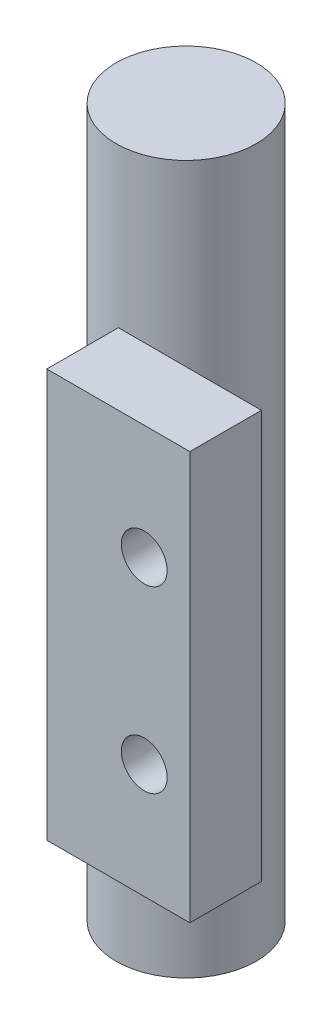
ISO-10303-21;
HEADER;
FILE_DESCRIPTION(('STEP AP214'),'2;1');
FILE_NAME('part.step','',(''),(''),'','','');
FILE_SCHEMA(('AUTOMOTIVE_DESIGN { 1 0 10303 214 1 1 1 1 }'));
ENDSEC;
DATA;
#1=APPLICATION_CONTEXT('core data for automotive mechanical design processes');
#2=APPLICATION_PROTOCOL_DEFINITION('international standard','automotive_design',2000,#1);
#3=PRODUCT_CONTEXT('',#1,'mechanical');
#4=PRODUCT('Part','Part','',(#3));
#5=PRODUCT_RELATED_PRODUCT_CATEGORY('part','',(#4));
#6=PRODUCT_DEFINITION_FORMATION('','',#4);
#7=PRODUCT_DEFINITION_CONTEXT('part definition',#1,'design');
#8=PRODUCT_DEFINITION('design','',#6,#7);
#9=PRODUCT_DEFINITION_SHAPE('','',#8);
#10=(LENGTH_UNIT() NAMED_UNIT(*) SI_UNIT(.MILLI.,.METRE.));
#11=(NAMED_UNIT(*) PLANE_ANGLE_UNIT() SI_UNIT($,.RADIAN.));
#12=(NAMED_UNIT(*) SI_UNIT($,.STERADIAN.) SOLID_ANGLE_UNIT());
#13=UNCERTAINTY_MEASURE_WITH_UNIT(LENGTH_MEASURE(1.E-05),#10,'distance_accuracy_value','');
#14=(GEOMETRIC_REPRESENTATION_CONTEXT(3) GLOBAL_UNCERTAINTY_ASSIGNED_CONTEXT((#13)) GLOBAL_UNIT_ASSIGNED_CONTEXT((#10,
#11,#12)) REPRESENTATION_CONTEXT('',''));
#15=CARTESIAN_POINT('',(0.,0.,0.));
#16=DIRECTION('',(0.,0.,1.));
#17=DIRECTION('',(1.,0.,0.));
#18=AXIS2_PLACEMENT_3D('',#15,#16,#17);
#19=CARTESIAN_POINT('',(-1.21410888509384,8.53481015756942,-5.9555332189598));
#20=DIRECTION('',(0.,-1.,0.));
#21=DIRECTION('',(1.,0.,0.));
#22=AXIS2_PLACEMENT_3D('',#19,#20,#21);
#23=CYLINDRICAL_SURFACE('',#22,4.9);
#24=CARTESIAN_POINT('',(-1.21410888509384,8.53481015756942,-5.9555332189598));
#25=DIRECTION('',(0.,-1.,0.));
#26=DIRECTION('',(1.,0.,0.));
#27=AXIS2_PLACEMENT_3D('',#24,#25,#26);
#28=CIRCLE('',#27,4.9);
#29=CARTESIAN_POINT('',(3.68589111490616,8.53481015756942,-5.9555332189598));
#30=VERTEX_POINT('',#29);
#31=EDGE_CURVE('E11',#30,#30,#28,.T.);
#32=ORIENTED_EDGE('',*,*,#31,.T.);
#33=EDGE_LOOP('',(#32));
#34=FACE_BOUND('',#33,.T.);
#35=CARTESIAN_POINT('',(-1.21410888509382,-40.9651898424306,-5.95553321895981));
#36=DIRECTION('',(0.,-1.,0.));
#37=DIRECTION('',(1.,0.,0.));
#38=AXIS2_PLACEMENT_3D('',#35,#36,#37);
#39=CIRCLE('',#38,4.9);
#40=CARTESIAN_POINT('',(3.68589111490618,-40.9651898424306,-5.95553321895981));
#41=VERTEX_POINT('',#40);
#42=EDGE_CURVE('E45',#41,#41,#39,.T.);
#43=ORIENTED_EDGE('',*,*,#42,.F.);
#44=EDGE_LOOP('',(#43));
#45=FACE_BOUND('',#44,.T.);
#46=ADVANCED_FACE('F42',(#34,#45),#23,.T.);
#47=CARTESIAN_POINT('',(-1.21410888509384,8.53481015756942,-5.9555332189598));
#48=DIRECTION('',(0.,-1.,0.));
#49=DIRECTION('',(1.,0.,0.));
#50=AXIS2_PLACEMENT_3D('',#47,#48,#49);
#51=PLANE('',#50);
#52=ORIENTED_EDGE('',*,*,#31,.F.);
#53=EDGE_LOOP('',(#52));
#54=FACE_BOUND('',#53,.T.);
#55=ADVANCED_FACE('F57',(#54),#51,.F.);
#56=CARTESIAN_POINT('',(-1.21410888509382,-40.9651898424306,-5.95553321895981));
#57=DIRECTION('',(0.,-1.,0.));
#58=DIRECTION('',(1.,0.,0.));
#59=AXIS2_PLACEMENT_3D('',#56,#57,#58);
#60=PLANE('',#59);
#61=ORIENTED_EDGE('',*,*,#42,.T.);
#62=EDGE_LOOP('',(#61));
#63=FACE_BOUND('',#62,.T.);
#64=ADVANCED_FACE('F54',(#63),#60,.T.);
#65=CLOSED_SHELL('',(#46,#55,#64));
#66=MANIFOLD_SOLID_BREP('B2',#65);
#67=CARTESIAN_POINT('',(10.,-1.47000000000001,5.));
#68=DIRECTION('',(-1.,0.,0.));
#69=DIRECTION('',(0.,-1.,0.));
#70=AXIS2_PLACEMENT_3D('',#67,#68,#69);
#71=PLANE('',#70);
#72=DIRECTION('',(0.,1.,0.));
#73=VECTOR('',#72,1.);
#74=CARTESIAN_POINT('',(10.,-1.47000000000001,0.));
#75=LINE('',#74,#73);
#76=CARTESIAN_POINT('',(10.,-30.,0.));
#77=VERTEX_POINT('',#76);
#78=CARTESIAN_POINT('',(10.,-1.47000000000001,0.));
#79=VERTEX_POINT('',#78);
#80=EDGE_CURVE('E145',#77,#79,#75,.T.);
#81=ORIENTED_EDGE('',*,*,#80,.T.);
#82=DIRECTION('',(0.,0.,-1.));
#83=VECTOR('',#82,1.);
#84=CARTESIAN_POINT('',(10.,-1.47000000000001,5.));
#85=LINE('',#84,#83);
#86=CARTESIAN_POINT('',(10.,-1.47000000000001,5.));
#87=VERTEX_POINT('',#86);
#88=EDGE_CURVE('E40',#87,#79,#85,.T.);
#89=ORIENTED_EDGE('',*,*,#88,.F.);
#90=DIRECTION('',(0.,1.,0.));
#91=VECTOR('',#90,1.);
#92=CARTESIAN_POINT('',(10.,-1.47000000000001,5.));
#93=LINE('',#92,#91);
#94=CARTESIAN_POINT('',(10.,-30.,5.));
#95=VERTEX_POINT('',#94);
#96=EDGE_CURVE('E133',#95,#87,#93,.T.);
#97=ORIENTED_EDGE('',*,*,#96,.F.);
#98=DIRECTION('',(0.,0.,-1.));
#99=VECTOR('',#98,1.);
#100=CARTESIAN_POINT('',(10.,-30.,5.));
#101=LINE('',#100,#99);
#102=EDGE_CURVE('E141',#95,#77,#101,.T.);
#103=ORIENTED_EDGE('',*,*,#102,.T.);
#104=EDGE_LOOP('',(#81,#89,#97,#103));
#105=FACE_BOUND('',#104,.T.);
#106=ADVANCED_FACE('F82',(#105),#71,.F.);
#107=CARTESIAN_POINT('',(10.,-1.47000000000001,5.));
#108=DIRECTION('',(0.,-1.,0.));
#109=DIRECTION('',(1.,0.,0.));
#110=AXIS2_PLACEMENT_3D('',#107,#108,#109);
#111=PLANE('',#110);
#112=DIRECTION('',(-1.,0.,0.));
#113=VECTOR('',#112,1.);
#114=CARTESIAN_POINT('',(10.,-1.47000000000001,0.));
#115=LINE('',#114,#113);
#116=CARTESIAN_POINT('',(0.,-1.47000000000001,0.));
#117=VERTEX_POINT('',#116);
#118=EDGE_CURVE('E137',#79,#117,#115,.T.);
#119=ORIENTED_EDGE('',*,*,#118,.T.);
#120=DIRECTION('',(0.,0.,-1.));
#121=VECTOR('',#120,1.);
#122=CARTESIAN_POINT('',(0.,-1.47000000000001,5.));
#123=LINE('',#122,#121);
#124=CARTESIAN_POINT('',(0.,-1.47000000000001,5.));
#125=VERTEX_POINT('',#124);
#126=EDGE_CURVE('E90',#125,#117,#123,.T.);
#127=ORIENTED_EDGE('',*,*,#126,.F.);
#128=DIRECTION('',(-1.,0.,0.));
#129=VECTOR('',#128,1.);
#130=CARTESIAN_POINT('',(10.,-1.47000000000001,5.));
#131=LINE('',#130,#129);
#132=EDGE_CURVE('E128',#87,#125,#131,.T.);
#133=ORIENTED_EDGE('',*,*,#132,.F.);
#134=ORIENTED_EDGE('',*,*,#88,.T.);
#135=EDGE_LOOP('',(#119,#127,#133,#134));
#136=FACE_BOUND('',#135,.T.);
#137=ADVANCED_FACE('F136',(#136),#111,.F.);
#138=CARTESIAN_POINT('',(0.,-1.47000000000001,5.));
#139=DIRECTION('',(1.,0.,0.));
#140=DIRECTION('',(0.,1.,0.));
#141=AXIS2_PLACEMENT_3D('',#138,#139,#140);
#142=PLANE('',#141);
#143=DIRECTION('',(0.,-1.,0.));
#144=VECTOR('',#143,1.);
#145=CARTESIAN_POINT('',(0.,-1.47000000000001,0.));
#146=LINE('',#145,#144);
#147=CARTESIAN_POINT('',(0.,-30.,0.));
#148=VERTEX_POINT('',#147);
#149=EDGE_CURVE('E115',#117,#148,#146,.T.);
#150=ORIENTED_EDGE('',*,*,#149,.T.);
#151=DIRECTION('',(0.,0.,-1.));
#152=VECTOR('',#151,1.);
#153=CARTESIAN_POINT('',(0.,-30.,5.));
#154=LINE('',#153,#152);
#155=CARTESIAN_POINT('',(0.,-30.,5.));
#156=VERTEX_POINT('',#155);
#157=EDGE_CURVE('E138',#156,#148,#154,.T.);
#158=ORIENTED_EDGE('',*,*,#157,.F.);
#159=DIRECTION('',(0.,-1.,0.));
#160=VECTOR('',#159,1.);
#161=CARTESIAN_POINT('',(0.,-1.47000000000001,5.));
#162=LINE('',#161,#160);
#163=EDGE_CURVE('E131',#125,#156,#162,.T.);
#164=ORIENTED_EDGE('',*,*,#163,.F.);
#165=ORIENTED_EDGE('',*,*,#126,.T.);
#166=EDGE_LOOP('',(#150,#158,#164,#165));
#167=FACE_BOUND('',#166,.T.);
#168=ADVANCED_FACE('F139',(#167),#142,.F.);
#169=CARTESIAN_POINT('',(10.,-30.,5.));
#170=DIRECTION('',(0.,1.,0.));
#171=DIRECTION('',(-1.,0.,0.));
#172=AXIS2_PLACEMENT_3D('',#169,#170,#171);
#173=PLANE('',#172);
#174=DIRECTION('',(1.,0.,0.));
#175=VECTOR('',#174,1.);
#176=CARTESIAN_POINT('',(10.,-30.,0.));
#177=LINE('',#176,#175);
#178=EDGE_CURVE('E121',#148,#77,#177,.T.);
#179=ORIENTED_EDGE('',*,*,#178,.T.);
#180=ORIENTED_EDGE('',*,*,#102,.F.);
#181=DIRECTION('',(1.,0.,0.));
#182=VECTOR('',#181,1.);
#183=CARTESIAN_POINT('',(10.,-30.,5.));
#184=LINE('',#183,#182);
#185=EDGE_CURVE('E98',#156,#95,#184,.T.);
#186=ORIENTED_EDGE('',*,*,#185,.F.);
#187=ORIENTED_EDGE('',*,*,#157,.T.);
#188=EDGE_LOOP('',(#179,#180,#186,#187));
#189=FACE_BOUND('',#188,.T.);
#190=ADVANCED_FACE('F153',(#189),#173,.F.);
#191=CARTESIAN_POINT('',(0.,0.,5.));
#192=DIRECTION('',(0.,0.,-1.));
#193=DIRECTION('',(-1.,0.,0.));
#194=AXIS2_PLACEMENT_3D('',#191,#192,#193);
#195=PLANE('',#194);
#196=CARTESIAN_POINT('',(6.81031037360218,-9.47000000000007,5.));
#197=DIRECTION('',(0.,0.,-1.));
#198=DIRECTION('',(-1.,0.,0.));
#199=AXIS2_PLACEMENT_3D('',#196,#197,#198);
#200=CIRCLE('',#199,1.6);
#201=CARTESIAN_POINT('',(5.21031037360218,-9.47000000000007,5.));
#202=VERTEX_POINT('',#201);
#203=EDGE_CURVE('E148',#202,#202,#200,.T.);
#204=ORIENTED_EDGE('',*,*,#203,.T.);
#205=EDGE_LOOP('',(#204));
#206=FACE_BOUND('',#205,.T.);
#207=CARTESIAN_POINT('',(6.81031037360219,-22.0000000000001,5.));
#208=DIRECTION('',(0.,0.,-1.));
#209=DIRECTION('',(-1.,0.,0.));
#210=AXIS2_PLACEMENT_3D('',#207,#208,#209);
#211=CIRCLE('',#210,1.6);
#212=CARTESIAN_POINT('',(5.21031037360218,-22.0000000000001,5.));
#213=VERTEX_POINT('',#212);
#214=EDGE_CURVE('E161',#213,#213,#211,.T.);
#215=ORIENTED_EDGE('',*,*,#214,.T.);
#216=EDGE_LOOP('',(#215));
#217=FACE_BOUND('',#216,.T.);
#218=ORIENTED_EDGE('',*,*,#96,.T.);
#219=ORIENTED_EDGE('',*,*,#132,.T.);
#220=ORIENTED_EDGE('',*,*,#163,.T.);
#221=ORIENTED_EDGE('',*,*,#185,.T.);
#222=EDGE_LOOP('',(#218,#219,#220,#221));
#223=FACE_BOUND('',#222,.T.);
#224=ADVANCED_FACE('F129',(#206,#217,#223),#195,.F.);
#225=CARTESIAN_POINT('',(0.,0.,0.));
#226=DIRECTION('',(0.,0.,-1.));
#227=DIRECTION('',(-1.,0.,0.));
#228=AXIS2_PLACEMENT_3D('',#225,#226,#227);
#229=PLANE('',#228);
#230=CARTESIAN_POINT('',(6.81031037360218,-9.47000000000007,0.));
#231=DIRECTION('',(0.,0.,-1.));
#232=DIRECTION('',(-1.,0.,0.));
#233=AXIS2_PLACEMENT_3D('',#230,#231,#232);
#234=CIRCLE('',#233,1.6);
#235=CARTESIAN_POINT('',(5.21031037360218,-9.47000000000007,0.));
#236=VERTEX_POINT('',#235);
#237=EDGE_CURVE('E164',#236,#236,#234,.T.);
#238=ORIENTED_EDGE('',*,*,#237,.F.);
#239=EDGE_LOOP('',(#238));
#240=FACE_BOUND('',#239,.T.);
#241=CARTESIAN_POINT('',(6.81031037360219,-22.0000000000001,0.));
#242=DIRECTION('',(0.,0.,-1.));
#243=DIRECTION('',(-1.,0.,0.));
#244=AXIS2_PLACEMENT_3D('',#241,#242,#243);
#245=CIRCLE('',#244,1.6);
#246=CARTESIAN_POINT('',(5.21031037360218,-22.0000000000001,0.));
#247=VERTEX_POINT('',#246);
#248=EDGE_CURVE('E165',#247,#247,#245,.T.);
#249=ORIENTED_EDGE('',*,*,#248,.F.);
#250=EDGE_LOOP('',(#249));
#251=FACE_BOUND('',#250,.T.);
#252=ORIENTED_EDGE('',*,*,#80,.F.);
#253=ORIENTED_EDGE('',*,*,#178,.F.);
#254=ORIENTED_EDGE('',*,*,#149,.F.);
#255=ORIENTED_EDGE('',*,*,#118,.F.);
#256=EDGE_LOOP('',(#252,#253,#254,#255));
#257=FACE_BOUND('',#256,.T.);
#258=ADVANCED_FACE('F156',(#240,#251,#257),#229,.T.);
#259=CARTESIAN_POINT('',(6.81031037360219,-22.0000000000001,43.));
#260=DIRECTION('',(0.,0.,-1.));
#261=DIRECTION('',(-1.,0.,0.));
#262=AXIS2_PLACEMENT_3D('',#259,#260,#261);
#263=CYLINDRICAL_SURFACE('',#262,1.6);
#264=ORIENTED_EDGE('',*,*,#248,.T.);
#265=EDGE_LOOP('',(#264));
#266=FACE_BOUND('',#265,.T.);
#267=ORIENTED_EDGE('',*,*,#214,.F.);
#268=EDGE_LOOP('',(#267));
#269=FACE_BOUND('',#268,.T.);
#270=ADVANCED_FACE('F176',(#266,#269),#263,.F.);
#271=CARTESIAN_POINT('',(6.81031037360218,-9.47000000000007,43.));
#272=DIRECTION('',(0.,0.,-1.));
#273=DIRECTION('',(-1.,0.,0.));
#274=AXIS2_PLACEMENT_3D('',#271,#272,#273);
#275=CYLINDRICAL_SURFACE('',#274,1.6);
#276=ORIENTED_EDGE('',*,*,#237,.T.);
#277=EDGE_LOOP('',(#276));
#278=FACE_BOUND('',#277,.T.);
#279=ORIENTED_EDGE('',*,*,#203,.F.);
#280=EDGE_LOOP('',(#279));
#281=FACE_BOUND('',#280,.T.);
#282=ADVANCED_FACE('F171',(#278,#281),#275,.F.);
#283=CLOSED_SHELL('',(#106,#137,#168,#190,#224,#258,#270,#282));
#284=MANIFOLD_SOLID_BREP('B6',#283);
#285=ADVANCED_BREP_SHAPE_REPRESENTATION('',(#18,#66,#284),#14);
#286=SHAPE_DEFINITION_REPRESENTATION(#9,#285);
ENDSEC;
END-ISO-10303-21;
